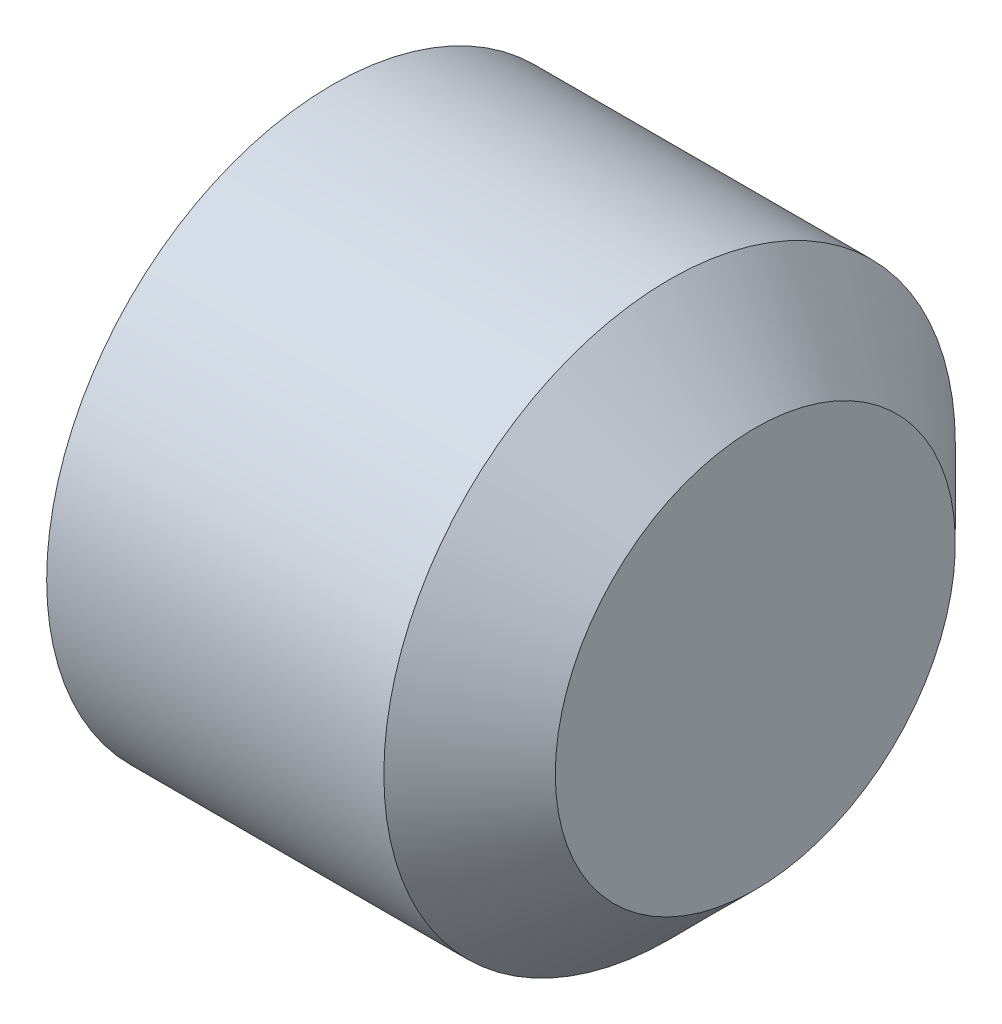
ISO-10303-21;
HEADER;
FILE_DESCRIPTION(('STEP AP214'),'2;1');
FILE_NAME('part.step','',(''),(''),'','','');
FILE_SCHEMA(('AUTOMOTIVE_DESIGN { 1 0 10303 214 1 1 1 1 }'));
ENDSEC;
DATA;
#1=APPLICATION_CONTEXT('core data for automotive mechanical design processes');
#2=APPLICATION_PROTOCOL_DEFINITION('international standard','automotive_design',2000,#1);
#3=PRODUCT_CONTEXT('',#1,'mechanical');
#4=PRODUCT('Part','Part','',(#3));
#5=PRODUCT_RELATED_PRODUCT_CATEGORY('part','',(#4));
#6=PRODUCT_DEFINITION_FORMATION('','',#4);
#7=PRODUCT_DEFINITION_CONTEXT('part definition',#1,'design');
#8=PRODUCT_DEFINITION('design','',#6,#7);
#9=PRODUCT_DEFINITION_SHAPE('','',#8);
#10=(LENGTH_UNIT() NAMED_UNIT(*) SI_UNIT(.MILLI.,.METRE.));
#11=(NAMED_UNIT(*) PLANE_ANGLE_UNIT() SI_UNIT($,.RADIAN.));
#12=(NAMED_UNIT(*) SI_UNIT($,.STERADIAN.) SOLID_ANGLE_UNIT());
#13=UNCERTAINTY_MEASURE_WITH_UNIT(LENGTH_MEASURE(1.E-05),#10,'distance_accuracy_value','');
#14=(GEOMETRIC_REPRESENTATION_CONTEXT(3) GLOBAL_UNCERTAINTY_ASSIGNED_CONTEXT((#13)) GLOBAL_UNIT_ASSIGNED_CONTEXT((#10,
#11,#12)) REPRESENTATION_CONTEXT('',''));
#15=CARTESIAN_POINT('',(0.,0.,0.));
#16=DIRECTION('',(0.,0.,1.));
#17=DIRECTION('',(1.,0.,0.));
#18=AXIS2_PLACEMENT_3D('',#15,#16,#17);
#19=CARTESIAN_POINT('',(0.,2.5,0.));
#20=DIRECTION('',(1.,0.,0.));
#21=DIRECTION('',(0.,0.,-1.));
#22=AXIS2_PLACEMENT_3D('',#19,#20,#21);
#23=PLANE('',#22);
#24=CARTESIAN_POINT('',(0.,0.,0.));
#25=DIRECTION('',(1.,0.,0.));
#26=DIRECTION('',(0.,0.,-1.));
#27=AXIS2_PLACEMENT_3D('',#24,#25,#26);
#28=CIRCLE('',#27,2.);
#29=CARTESIAN_POINT('',(0.,0.,-2.));
#30=VERTEX_POINT('',#29);
#31=EDGE_CURVE('E40',#30,#30,#28,.F.);
#32=ORIENTED_EDGE('',*,*,#31,.T.);
#33=EDGE_LOOP('',(#32));
#34=FACE_BOUND('',#33,.T.);
#35=DIRECTION('',(0.,0.,1.));
#36=VECTOR('',#35,1.);
#37=CARTESIAN_POINT('',(0.,1.25,-0.721687836487033));
#38=LINE('',#37,#36);
#39=CARTESIAN_POINT('',(0.,1.25,-0.721687836487033));
#40=VERTEX_POINT('',#39);
#41=CARTESIAN_POINT('',(0.,1.25,0.721687836487032));
#42=VERTEX_POINT('',#41);
#43=EDGE_CURVE('E47',#40,#42,#38,.T.);
#44=ORIENTED_EDGE('',*,*,#43,.T.);
#45=DIRECTION('',(0.,-0.866025403784439,0.5));
#46=VECTOR('',#45,1.);
#47=CARTESIAN_POINT('',(0.,1.25,0.721687836487032));
#48=LINE('',#47,#46);
#49=CARTESIAN_POINT('',(0.,0.,1.44337567297406));
#50=VERTEX_POINT('',#49);
#51=EDGE_CURVE('E118',#42,#50,#48,.T.);
#52=ORIENTED_EDGE('',*,*,#51,.T.);
#53=DIRECTION('',(0.,-0.866025403784439,-0.5));
#54=VECTOR('',#53,1.);
#55=CARTESIAN_POINT('',(0.,0.,1.44337567297406));
#56=LINE('',#55,#54);
#57=CARTESIAN_POINT('',(0.,-1.25,0.721687836487032));
#58=VERTEX_POINT('',#57);
#59=EDGE_CURVE('E121',#50,#58,#56,.T.);
#60=ORIENTED_EDGE('',*,*,#59,.T.);
#61=DIRECTION('',(0.,0.,-1.));
#62=VECTOR('',#61,1.);
#63=CARTESIAN_POINT('',(0.,-1.25,0.721687836487032));
#64=LINE('',#63,#62);
#65=CARTESIAN_POINT('',(0.,-1.25,-0.721687836487032));
#66=VERTEX_POINT('',#65);
#67=EDGE_CURVE('E124',#58,#66,#64,.T.);
#68=ORIENTED_EDGE('',*,*,#67,.T.);
#69=DIRECTION('',(0.,0.866025403784438,-0.5));
#70=VECTOR('',#69,1.);
#71=CARTESIAN_POINT('',(0.,-1.25,-0.721687836487032));
#72=LINE('',#71,#70);
#73=CARTESIAN_POINT('',(0.,0.,-1.44337567297406));
#74=VERTEX_POINT('',#73);
#75=EDGE_CURVE('E108',#66,#74,#72,.T.);
#76=ORIENTED_EDGE('',*,*,#75,.T.);
#77=DIRECTION('',(0.,0.866025403784439,0.5));
#78=VECTOR('',#77,1.);
#79=CARTESIAN_POINT('',(0.,0.,-1.44337567297406));
#80=LINE('',#79,#78);
#81=EDGE_CURVE('E127',#74,#40,#80,.T.);
#82=ORIENTED_EDGE('',*,*,#81,.T.);
#83=EDGE_LOOP('',(#44,#52,#60,#68,#76,#82));
#84=FACE_BOUND('',#83,.T.);
#85=ADVANCED_FACE('F32',(#34,#84),#23,.F.);
#86=CARTESIAN_POINT('',(3.99999999996226,2.5,0.));
#87=DIRECTION('',(-1.,0.,0.));
#88=DIRECTION('',(0.,0.,1.));
#89=AXIS2_PLACEMENT_3D('',#86,#87,#88);
#90=PLANE('',#89);
#91=CARTESIAN_POINT('',(3.99999999996226,0.,0.));
#92=DIRECTION('',(-1.,0.,0.));
#93=DIRECTION('',(0.,0.,1.));
#94=AXIS2_PLACEMENT_3D('',#91,#92,#93);
#95=CIRCLE('',#94,1.75);
#96=CARTESIAN_POINT('',(3.99999999996226,0.,1.75));
#97=VERTEX_POINT('',#96);
#98=EDGE_CURVE('E141',#97,#97,#95,.F.);
#99=ORIENTED_EDGE('',*,*,#98,.T.);
#100=EDGE_LOOP('',(#99));
#101=FACE_BOUND('',#100,.T.);
#102=ADVANCED_FACE('F157',(#101),#90,.F.);
#103=CARTESIAN_POINT('',(-0.394679186578465,0.,0.));
#104=DIRECTION('',(-1.,0.,0.));
#105=DIRECTION('',(0.,0.,1.));
#106=AXIS2_PLACEMENT_3D('',#103,#104,#105);
#107=CYLINDRICAL_SURFACE('',#106,2.5);
#108=CARTESIAN_POINT('',(0.300000000000001,0.,0.));
#109=DIRECTION('',(1.,0.,0.));
#110=DIRECTION('',(0.,0.,-1.));
#111=AXIS2_PLACEMENT_3D('',#108,#109,#110);
#112=CIRCLE('',#111,2.5);
#113=CARTESIAN_POINT('',(0.300000000000001,0.,-2.5));
#114=VERTEX_POINT('',#113);
#115=EDGE_CURVE('E11',#114,#114,#112,.T.);
#116=ORIENTED_EDGE('',*,*,#115,.T.);
#117=EDGE_LOOP('',(#116));
#118=FACE_BOUND('',#117,.T.);
#119=CARTESIAN_POINT('',(3.24999999996226,0.,0.));
#120=DIRECTION('',(-1.,0.,0.));
#121=DIRECTION('',(0.,0.,1.));
#122=AXIS2_PLACEMENT_3D('',#119,#120,#121);
#123=CIRCLE('',#122,2.5);
#124=CARTESIAN_POINT('',(3.24999999996226,0.,2.5));
#125=VERTEX_POINT('',#124);
#126=EDGE_CURVE('E138',#125,#125,#123,.T.);
#127=ORIENTED_EDGE('',*,*,#126,.T.);
#128=EDGE_LOOP('',(#127));
#129=FACE_BOUND('',#128,.T.);
#130=ADVANCED_FACE('F162',(#118,#129),#107,.T.);
#131=CARTESIAN_POINT('',(2.,1.25,-0.721687836487033));
#132=DIRECTION('',(0.,-1.,0.));
#133=DIRECTION('',(0.,0.,-1.));
#134=AXIS2_PLACEMENT_3D('',#131,#132,#133);
#135=PLANE('',#134);
#136=ORIENTED_EDGE('',*,*,#43,.F.);
#137=DIRECTION('',(-1.,0.,0.));
#138=VECTOR('',#137,1.);
#139=CARTESIAN_POINT('',(2.,1.25,-0.721687836487033));
#140=LINE('',#139,#138);
#141=CARTESIAN_POINT('',(2.,1.25,-0.721687836487033));
#142=VERTEX_POINT('',#141);
#143=EDGE_CURVE('E113',#142,#40,#140,.T.);
#144=ORIENTED_EDGE('',*,*,#143,.F.);
#145=DIRECTION('',(0.,0.,1.));
#146=VECTOR('',#145,1.);
#147=CARTESIAN_POINT('',(2.,1.25,-0.721687836487033));
#148=LINE('',#147,#146);
#149=CARTESIAN_POINT('',(2.,1.25,0.721687836487032));
#150=VERTEX_POINT('',#149);
#151=EDGE_CURVE('E130',#142,#150,#148,.T.);
#152=ORIENTED_EDGE('',*,*,#151,.T.);
#153=DIRECTION('',(-1.,0.,0.));
#154=VECTOR('',#153,1.);
#155=CARTESIAN_POINT('',(2.,1.25,0.721687836487032));
#156=LINE('',#155,#154);
#157=EDGE_CURVE('E136',#150,#42,#156,.T.);
#158=ORIENTED_EDGE('',*,*,#157,.T.);
#159=EDGE_LOOP('',(#136,#144,#152,#158));
#160=FACE_BOUND('',#159,.T.);
#161=ADVANCED_FACE('F168',(#160),#135,.T.);
#162=CARTESIAN_POINT('',(2.,1.25,0.721687836487032));
#163=DIRECTION('',(0.,-0.5,-0.866025403784439));
#164=DIRECTION('',(0.,0.866025403784439,-0.5));
#165=AXIS2_PLACEMENT_3D('',#162,#163,#164);
#166=PLANE('',#165);
#167=ORIENTED_EDGE('',*,*,#51,.F.);
#168=ORIENTED_EDGE('',*,*,#157,.F.);
#169=DIRECTION('',(0.,-0.866025403784439,0.5));
#170=VECTOR('',#169,1.);
#171=CARTESIAN_POINT('',(2.,1.25,0.721687836487032));
#172=LINE('',#171,#170);
#173=CARTESIAN_POINT('',(2.,0.,1.44337567297406));
#174=VERTEX_POINT('',#173);
#175=EDGE_CURVE('E86',#150,#174,#172,.T.);
#176=ORIENTED_EDGE('',*,*,#175,.T.);
#177=DIRECTION('',(-1.,0.,0.));
#178=VECTOR('',#177,1.);
#179=CARTESIAN_POINT('',(2.,0.,1.44337567297406));
#180=LINE('',#179,#178);
#181=EDGE_CURVE('E134',#174,#50,#180,.T.);
#182=ORIENTED_EDGE('',*,*,#181,.T.);
#183=EDGE_LOOP('',(#167,#168,#176,#182));
#184=FACE_BOUND('',#183,.T.);
#185=ADVANCED_FACE('F172',(#184),#166,.T.);
#186=CARTESIAN_POINT('',(2.,0.,1.44337567297406));
#187=DIRECTION('',(0.,0.5,-0.866025403784439));
#188=DIRECTION('',(0.,0.866025403784439,0.5));
#189=AXIS2_PLACEMENT_3D('',#186,#187,#188);
#190=PLANE('',#189);
#191=ORIENTED_EDGE('',*,*,#59,.F.);
#192=ORIENTED_EDGE('',*,*,#181,.F.);
#193=DIRECTION('',(0.,-0.866025403784439,-0.5));
#194=VECTOR('',#193,1.);
#195=CARTESIAN_POINT('',(2.,0.,1.44337567297406));
#196=LINE('',#195,#194);
#197=CARTESIAN_POINT('',(2.,-1.25,0.721687836487032));
#198=VERTEX_POINT('',#197);
#199=EDGE_CURVE('E104',#174,#198,#196,.T.);
#200=ORIENTED_EDGE('',*,*,#199,.T.);
#201=DIRECTION('',(-1.,0.,0.));
#202=VECTOR('',#201,1.);
#203=CARTESIAN_POINT('',(2.,-1.25,0.721687836487032));
#204=LINE('',#203,#202);
#205=EDGE_CURVE('E101',#198,#58,#204,.T.);
#206=ORIENTED_EDGE('',*,*,#205,.T.);
#207=EDGE_LOOP('',(#191,#192,#200,#206));
#208=FACE_BOUND('',#207,.T.);
#209=ADVANCED_FACE('F175',(#208),#190,.T.);
#210=CARTESIAN_POINT('',(2.,-1.25,0.721687836487032));
#211=DIRECTION('',(0.,1.,0.));
#212=DIRECTION('',(0.,0.,1.));
#213=AXIS2_PLACEMENT_3D('',#210,#211,#212);
#214=PLANE('',#213);
#215=ORIENTED_EDGE('',*,*,#67,.F.);
#216=ORIENTED_EDGE('',*,*,#205,.F.);
#217=DIRECTION('',(0.,0.,-1.));
#218=VECTOR('',#217,1.);
#219=CARTESIAN_POINT('',(2.,-1.25,0.721687836487032));
#220=LINE('',#219,#218);
#221=CARTESIAN_POINT('',(2.,-1.25,-0.721687836487032));
#222=VERTEX_POINT('',#221);
#223=EDGE_CURVE('E96',#198,#222,#220,.T.);
#224=ORIENTED_EDGE('',*,*,#223,.T.);
#225=DIRECTION('',(-1.,0.,0.));
#226=VECTOR('',#225,1.);
#227=CARTESIAN_POINT('',(2.,-1.25,-0.721687836487032));
#228=LINE('',#227,#226);
#229=EDGE_CURVE('E100',#222,#66,#228,.T.);
#230=ORIENTED_EDGE('',*,*,#229,.T.);
#231=EDGE_LOOP('',(#215,#216,#224,#230));
#232=FACE_BOUND('',#231,.T.);
#233=ADVANCED_FACE('F99',(#232),#214,.T.);
#234=CARTESIAN_POINT('',(2.,-1.25,-0.721687836487032));
#235=DIRECTION('',(0.,0.5,0.866025403784439));
#236=DIRECTION('',(0.,-0.866025403784438,0.5));
#237=AXIS2_PLACEMENT_3D('',#234,#235,#236);
#238=PLANE('',#237);
#239=ORIENTED_EDGE('',*,*,#75,.F.);
#240=ORIENTED_EDGE('',*,*,#229,.F.);
#241=DIRECTION('',(0.,0.866025403784438,-0.5));
#242=VECTOR('',#241,1.);
#243=CARTESIAN_POINT('',(2.,-1.25,-0.721687836487032));
#244=LINE('',#243,#242);
#245=CARTESIAN_POINT('',(2.,0.,-1.44337567297406));
#246=VERTEX_POINT('',#245);
#247=EDGE_CURVE('E103',#222,#246,#244,.T.);
#248=ORIENTED_EDGE('',*,*,#247,.T.);
#249=DIRECTION('',(-1.,0.,0.));
#250=VECTOR('',#249,1.);
#251=CARTESIAN_POINT('',(2.,0.,-1.44337567297406));
#252=LINE('',#251,#250);
#253=EDGE_CURVE('E77',#246,#74,#252,.T.);
#254=ORIENTED_EDGE('',*,*,#253,.T.);
#255=EDGE_LOOP('',(#239,#240,#248,#254));
#256=FACE_BOUND('',#255,.T.);
#257=ADVANCED_FACE('F106',(#256),#238,.T.);
#258=CARTESIAN_POINT('',(2.,0.,-1.44337567297406));
#259=DIRECTION('',(0.,-0.5,0.866025403784439));
#260=DIRECTION('',(0.,-0.866025403784439,-0.5));
#261=AXIS2_PLACEMENT_3D('',#258,#259,#260);
#262=PLANE('',#261);
#263=ORIENTED_EDGE('',*,*,#81,.F.);
#264=ORIENTED_EDGE('',*,*,#253,.F.);
#265=DIRECTION('',(0.,0.866025403784439,0.5));
#266=VECTOR('',#265,1.);
#267=CARTESIAN_POINT('',(2.,0.,-1.44337567297406));
#268=LINE('',#267,#266);
#269=EDGE_CURVE('E55',#246,#142,#268,.T.);
#270=ORIENTED_EDGE('',*,*,#269,.T.);
#271=ORIENTED_EDGE('',*,*,#143,.T.);
#272=EDGE_LOOP('',(#263,#264,#270,#271));
#273=FACE_BOUND('',#272,.T.);
#274=ADVANCED_FACE('F184',(#273),#262,.T.);
#275=CARTESIAN_POINT('',(2.,1.25,0.721687836487032));
#276=DIRECTION('',(1.,0.,0.));
#277=DIRECTION('',(0.,0.,-1.));
#278=AXIS2_PLACEMENT_3D('',#275,#276,#277);
#279=PLANE('',#278);
#280=ORIENTED_EDGE('',*,*,#151,.F.);
#281=ORIENTED_EDGE('',*,*,#269,.F.);
#282=ORIENTED_EDGE('',*,*,#247,.F.);
#283=ORIENTED_EDGE('',*,*,#223,.F.);
#284=ORIENTED_EDGE('',*,*,#199,.F.);
#285=ORIENTED_EDGE('',*,*,#175,.F.);
#286=EDGE_LOOP('',(#280,#281,#282,#283,#284,#285));
#287=FACE_BOUND('',#286,.T.);
#288=ADVANCED_FACE('F111',(#287),#279,.F.);
#289=CARTESIAN_POINT('',(3.24999999996226,0.,0.));
#290=DIRECTION('',(-1.,0.,0.));
#291=DIRECTION('',(0.,0.,1.));
#292=AXIS2_PLACEMENT_3D('',#289,#290,#291);
#293=CONICAL_SURFACE('',#292,2.5,0.785398163397449);
#294=ORIENTED_EDGE('',*,*,#98,.F.);
#295=EDGE_LOOP('',(#294));
#296=FACE_BOUND('',#295,.T.);
#297=ORIENTED_EDGE('',*,*,#126,.F.);
#298=EDGE_LOOP('',(#297));
#299=FACE_BOUND('',#298,.T.);
#300=ADVANCED_FACE('F149',(#296,#299),#293,.T.);
#301=CARTESIAN_POINT('',(0.,0.,0.));
#302=DIRECTION('',(1.,0.,0.));
#303=DIRECTION('',(0.,0.,-1.));
#304=AXIS2_PLACEMENT_3D('',#301,#302,#303);
#305=CONICAL_SURFACE('',#304,2.,1.03037682652431);
#306=ORIENTED_EDGE('',*,*,#115,.F.);
#307=EDGE_LOOP('',(#306));
#308=FACE_BOUND('',#307,.T.);
#309=ORIENTED_EDGE('',*,*,#31,.F.);
#310=EDGE_LOOP('',(#309));
#311=FACE_BOUND('',#310,.T.);
#312=ADVANCED_FACE('F34',(#308,#311),#305,.T.);
#313=CLOSED_SHELL('',(#85,#102,#130,#161,#185,#209,#233,#257,#274,#288,#300,#312));
#314=MANIFOLD_SOLID_BREP('B2',#313);
#315=ADVANCED_BREP_SHAPE_REPRESENTATION('',(#18,#314),#14);
#316=SHAPE_DEFINITION_REPRESENTATION(#9,#315);
ENDSEC;
END-ISO-10303-21;
